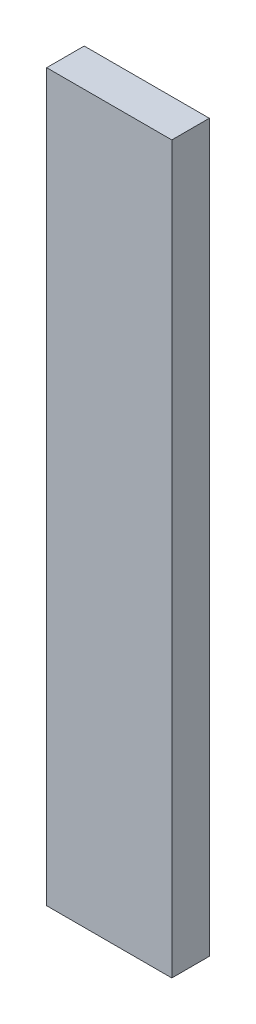
ISO-10303-21;
HEADER;
FILE_DESCRIPTION(('STEP AP214'),'2;1');
FILE_NAME('part.step','',(''),(''),'','','');
FILE_SCHEMA(('AUTOMOTIVE_DESIGN { 1 0 10303 214 1 1 1 1 }'));
ENDSEC;
DATA;
#1=APPLICATION_CONTEXT('core data for automotive mechanical design processes');
#2=APPLICATION_PROTOCOL_DEFINITION('international standard','automotive_design',2000,#1);
#3=PRODUCT_CONTEXT('',#1,'mechanical');
#4=PRODUCT('Part','Part','',(#3));
#5=PRODUCT_RELATED_PRODUCT_CATEGORY('part','',(#4));
#6=PRODUCT_DEFINITION_FORMATION('','',#4);
#7=PRODUCT_DEFINITION_CONTEXT('part definition',#1,'design');
#8=PRODUCT_DEFINITION('design','',#6,#7);
#9=PRODUCT_DEFINITION_SHAPE('','',#8);
#10=(LENGTH_UNIT() NAMED_UNIT(*) SI_UNIT(.MILLI.,.METRE.));
#11=(NAMED_UNIT(*) PLANE_ANGLE_UNIT() SI_UNIT($,.RADIAN.));
#12=(NAMED_UNIT(*) SI_UNIT($,.STERADIAN.) SOLID_ANGLE_UNIT());
#13=UNCERTAINTY_MEASURE_WITH_UNIT(LENGTH_MEASURE(1.E-05),#10,'distance_accuracy_value','');
#14=(GEOMETRIC_REPRESENTATION_CONTEXT(3) GLOBAL_UNCERTAINTY_ASSIGNED_CONTEXT((#13)) GLOBAL_UNIT_ASSIGNED_CONTEXT((#10,
#11,#12)) REPRESENTATION_CONTEXT('',''));
#15=CARTESIAN_POINT('',(0.,0.,0.));
#16=DIRECTION('',(0.,0.,1.));
#17=DIRECTION('',(1.,0.,0.));
#18=AXIS2_PLACEMENT_3D('',#15,#16,#17);
#19=CARTESIAN_POINT('',(-10.,78.,6.));
#20=DIRECTION('',(1.,0.,0.));
#21=DIRECTION('',(0.,1.,0.));
#22=AXIS2_PLACEMENT_3D('',#19,#20,#21);
#23=PLANE('',#22);
#24=DIRECTION('',(0.,-1.,0.));
#25=VECTOR('',#24,1.);
#26=CARTESIAN_POINT('',(-10.,78.,0.));
#27=LINE('',#26,#25);
#28=CARTESIAN_POINT('',(-10.,78.,0.));
#29=VERTEX_POINT('',#28);
#30=CARTESIAN_POINT('',(-9.99999999999999,-38.,0.));
#31=VERTEX_POINT('',#30);
#32=EDGE_CURVE('E96',#29,#31,#27,.T.);
#33=ORIENTED_EDGE('',*,*,#32,.T.);
#34=DIRECTION('',(0.,0.,-1.));
#35=VECTOR('',#34,1.);
#36=CARTESIAN_POINT('',(-9.99999999999999,-38.,6.));
#37=LINE('',#36,#35);
#38=CARTESIAN_POINT('',(-9.99999999999999,-38.,6.));
#39=VERTEX_POINT('',#38);
#40=EDGE_CURVE('E11',#39,#31,#37,.T.);
#41=ORIENTED_EDGE('',*,*,#40,.F.);
#42=DIRECTION('',(0.,-1.,0.));
#43=VECTOR('',#42,1.);
#44=CARTESIAN_POINT('',(-10.,78.,6.));
#45=LINE('',#44,#43);
#46=CARTESIAN_POINT('',(-10.,78.,6.));
#47=VERTEX_POINT('',#46);
#48=EDGE_CURVE('E84',#47,#39,#45,.T.);
#49=ORIENTED_EDGE('',*,*,#48,.F.);
#50=DIRECTION('',(0.,0.,-1.));
#51=VECTOR('',#50,1.);
#52=CARTESIAN_POINT('',(-10.,78.,6.));
#53=LINE('',#52,#51);
#54=EDGE_CURVE('E92',#47,#29,#53,.T.);
#55=ORIENTED_EDGE('',*,*,#54,.T.);
#56=EDGE_LOOP('',(#33,#41,#49,#55));
#57=FACE_BOUND('',#56,.T.);
#58=ADVANCED_FACE('F33',(#57),#23,.F.);
#59=CARTESIAN_POINT('',(-9.99999999999999,-38.,6.));
#60=DIRECTION('',(0.,1.,0.));
#61=DIRECTION('',(-1.,0.,0.));
#62=AXIS2_PLACEMENT_3D('',#59,#60,#61);
#63=PLANE('',#62);
#64=DIRECTION('',(1.,0.,0.));
#65=VECTOR('',#64,1.);
#66=CARTESIAN_POINT('',(-9.99999999999999,-38.,0.));
#67=LINE('',#66,#65);
#68=CARTESIAN_POINT('',(10.,-38.,0.));
#69=VERTEX_POINT('',#68);
#70=EDGE_CURVE('E88',#31,#69,#67,.T.);
#71=ORIENTED_EDGE('',*,*,#70,.T.);
#72=DIRECTION('',(0.,0.,-1.));
#73=VECTOR('',#72,1.);
#74=CARTESIAN_POINT('',(10.,-38.,6.));
#75=LINE('',#74,#73);
#76=CARTESIAN_POINT('',(10.,-38.,6.));
#77=VERTEX_POINT('',#76);
#78=EDGE_CURVE('E41',#77,#69,#75,.T.);
#79=ORIENTED_EDGE('',*,*,#78,.F.);
#80=DIRECTION('',(1.,0.,0.));
#81=VECTOR('',#80,1.);
#82=CARTESIAN_POINT('',(-9.99999999999999,-38.,6.));
#83=LINE('',#82,#81);
#84=EDGE_CURVE('E79',#39,#77,#83,.T.);
#85=ORIENTED_EDGE('',*,*,#84,.F.);
#86=ORIENTED_EDGE('',*,*,#40,.T.);
#87=EDGE_LOOP('',(#71,#79,#85,#86));
#88=FACE_BOUND('',#87,.T.);
#89=ADVANCED_FACE('F87',(#88),#63,.F.);
#90=CARTESIAN_POINT('',(9.99999999999999,78.,6.));
#91=DIRECTION('',(-1.,0.,0.));
#92=DIRECTION('',(0.,-1.,0.));
#93=AXIS2_PLACEMENT_3D('',#90,#91,#92);
#94=PLANE('',#93);
#95=DIRECTION('',(0.,1.,0.));
#96=VECTOR('',#95,1.);
#97=CARTESIAN_POINT('',(9.99999999999999,78.,0.));
#98=LINE('',#97,#96);
#99=CARTESIAN_POINT('',(9.99999999999999,78.,0.));
#100=VERTEX_POINT('',#99);
#101=EDGE_CURVE('E66',#69,#100,#98,.T.);
#102=ORIENTED_EDGE('',*,*,#101,.T.);
#103=DIRECTION('',(0.,0.,-1.));
#104=VECTOR('',#103,1.);
#105=CARTESIAN_POINT('',(9.99999999999999,78.,6.));
#106=LINE('',#105,#104);
#107=CARTESIAN_POINT('',(9.99999999999999,78.,6.));
#108=VERTEX_POINT('',#107);
#109=EDGE_CURVE('E89',#108,#100,#106,.T.);
#110=ORIENTED_EDGE('',*,*,#109,.F.);
#111=DIRECTION('',(0.,1.,0.));
#112=VECTOR('',#111,1.);
#113=CARTESIAN_POINT('',(9.99999999999999,78.,6.));
#114=LINE('',#113,#112);
#115=EDGE_CURVE('E82',#77,#108,#114,.T.);
#116=ORIENTED_EDGE('',*,*,#115,.F.);
#117=ORIENTED_EDGE('',*,*,#78,.T.);
#118=EDGE_LOOP('',(#102,#110,#116,#117));
#119=FACE_BOUND('',#118,.T.);
#120=ADVANCED_FACE('F90',(#119),#94,.F.);
#121=CARTESIAN_POINT('',(-10.,78.,6.));
#122=DIRECTION('',(0.,-1.,0.));
#123=DIRECTION('',(0.,0.,-1.));
#124=AXIS2_PLACEMENT_3D('',#121,#122,#123);
#125=PLANE('',#124);
#126=DIRECTION('',(-1.,0.,0.));
#127=VECTOR('',#126,1.);
#128=CARTESIAN_POINT('',(-10.,78.,0.));
#129=LINE('',#128,#127);
#130=EDGE_CURVE('E72',#100,#29,#129,.T.);
#131=ORIENTED_EDGE('',*,*,#130,.T.);
#132=ORIENTED_EDGE('',*,*,#54,.F.);
#133=DIRECTION('',(-1.,0.,0.));
#134=VECTOR('',#133,1.);
#135=CARTESIAN_POINT('',(-10.,78.,6.));
#136=LINE('',#135,#134);
#137=EDGE_CURVE('E49',#108,#47,#136,.T.);
#138=ORIENTED_EDGE('',*,*,#137,.F.);
#139=ORIENTED_EDGE('',*,*,#109,.T.);
#140=EDGE_LOOP('',(#131,#132,#138,#139));
#141=FACE_BOUND('',#140,.T.);
#142=ADVANCED_FACE('F103',(#141),#125,.F.);
#143=CARTESIAN_POINT('',(0.,0.,6.));
#144=DIRECTION('',(0.,0.,1.));
#145=DIRECTION('',(1.,0.,0.));
#146=AXIS2_PLACEMENT_3D('',#143,#144,#145);
#147=PLANE('',#146);
#148=ORIENTED_EDGE('',*,*,#48,.T.);
#149=ORIENTED_EDGE('',*,*,#84,.T.);
#150=ORIENTED_EDGE('',*,*,#115,.T.);
#151=ORIENTED_EDGE('',*,*,#137,.T.);
#152=EDGE_LOOP('',(#148,#149,#150,#151));
#153=FACE_BOUND('',#152,.T.);
#154=ADVANCED_FACE('F80',(#153),#147,.T.);
#155=CARTESIAN_POINT('',(0.,0.,0.));
#156=DIRECTION('',(0.,0.,1.));
#157=DIRECTION('',(1.,0.,0.));
#158=AXIS2_PLACEMENT_3D('',#155,#156,#157);
#159=PLANE('',#158);
#160=ORIENTED_EDGE('',*,*,#32,.F.);
#161=ORIENTED_EDGE('',*,*,#130,.F.);
#162=ORIENTED_EDGE('',*,*,#101,.F.);
#163=ORIENTED_EDGE('',*,*,#70,.F.);
#164=EDGE_LOOP('',(#160,#161,#162,#163));
#165=FACE_BOUND('',#164,.T.);
#166=ADVANCED_FACE('F106',(#165),#159,.F.);
#167=CLOSED_SHELL('',(#58,#89,#120,#142,#154,#166));
#168=MANIFOLD_SOLID_BREP('B2',#167);
#169=ADVANCED_BREP_SHAPE_REPRESENTATION('',(#18,#168),#14);
#170=SHAPE_DEFINITION_REPRESENTATION(#9,#169);
ENDSEC;
END-ISO-10303-21;
